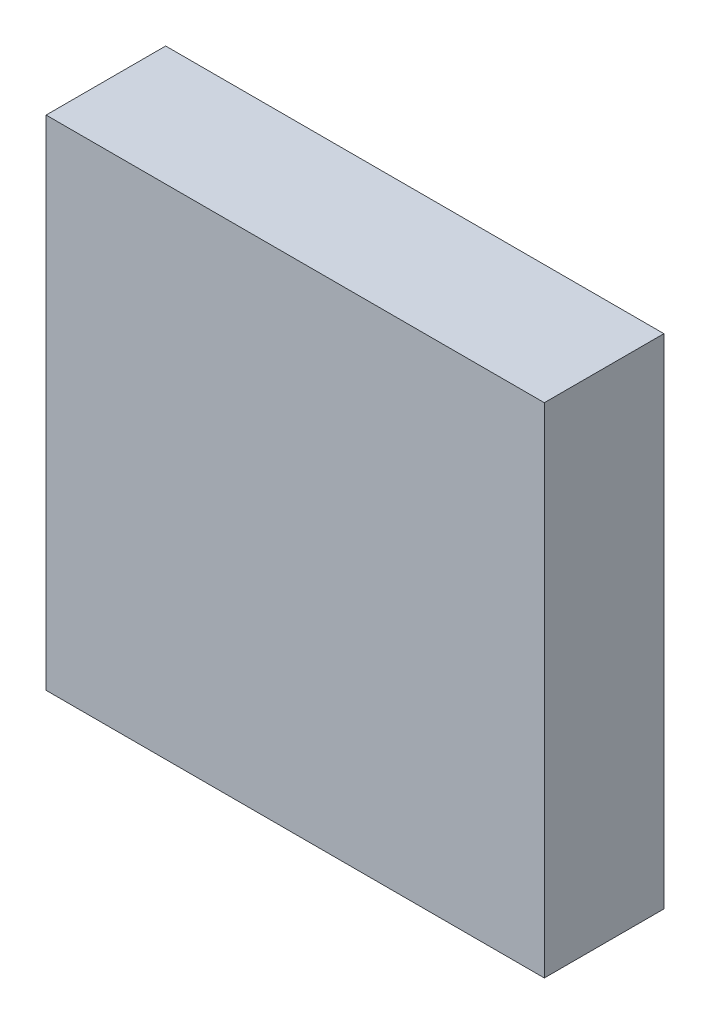
ISO-10303-21;
HEADER;
FILE_DESCRIPTION(('STEP AP214'),'2;1');
FILE_NAME('part.step','',(''),(''),'','','');
FILE_SCHEMA(('AUTOMOTIVE_DESIGN { 1 0 10303 214 1 1 1 1 }'));
ENDSEC;
DATA;
#1=APPLICATION_CONTEXT('core data for automotive mechanical design processes');
#2=APPLICATION_PROTOCOL_DEFINITION('international standard','automotive_design',2000,#1);
#3=PRODUCT_CONTEXT('',#1,'mechanical');
#4=PRODUCT('Part','Part','',(#3));
#5=PRODUCT_RELATED_PRODUCT_CATEGORY('part','',(#4));
#6=PRODUCT_DEFINITION_FORMATION('','',#4);
#7=PRODUCT_DEFINITION_CONTEXT('part definition',#1,'design');
#8=PRODUCT_DEFINITION('design','',#6,#7);
#9=PRODUCT_DEFINITION_SHAPE('','',#8);
#10=(LENGTH_UNIT() NAMED_UNIT(*) SI_UNIT(.MILLI.,.METRE.));
#11=(NAMED_UNIT(*) PLANE_ANGLE_UNIT() SI_UNIT($,.RADIAN.));
#12=(NAMED_UNIT(*) SI_UNIT($,.STERADIAN.) SOLID_ANGLE_UNIT());
#13=UNCERTAINTY_MEASURE_WITH_UNIT(LENGTH_MEASURE(1.E-05),#10,'distance_accuracy_value','');
#14=(GEOMETRIC_REPRESENTATION_CONTEXT(3) GLOBAL_UNCERTAINTY_ASSIGNED_CONTEXT((#13)) GLOBAL_UNIT_ASSIGNED_CONTEXT((#10,
#11,#12)) REPRESENTATION_CONTEXT('',''));
#15=CARTESIAN_POINT('',(0.,0.,0.));
#16=DIRECTION('',(0.,0.,1.));
#17=DIRECTION('',(1.,0.,0.));
#18=AXIS2_PLACEMENT_3D('',#15,#16,#17);
#19=CARTESIAN_POINT('',(233.308771728843,64.7931793490154,6.));
#20=DIRECTION('',(0.,1.,0.));
#21=DIRECTION('',(0.,0.,1.));
#22=AXIS2_PLACEMENT_3D('',#19,#20,#21);
#23=PLANE('',#22);
#24=DIRECTION('',(1.,0.,0.));
#25=VECTOR('',#24,1.);
#26=CARTESIAN_POINT('',(233.308771728843,64.7931793490154,0.));
#27=LINE('',#26,#25);
#28=CARTESIAN_POINT('',(208.308771728843,64.7931793490154,0.));
#29=VERTEX_POINT('',#28);
#30=CARTESIAN_POINT('',(233.308771728843,64.7931793490154,0.));
#31=VERTEX_POINT('',#30);
#32=EDGE_CURVE('E91',#29,#31,#27,.T.);
#33=ORIENTED_EDGE('',*,*,#32,.T.);
#34=DIRECTION('',(0.,0.,-1.));
#35=VECTOR('',#34,1.);
#36=CARTESIAN_POINT('',(233.308771728843,64.7931793490154,6.));
#37=LINE('',#36,#35);
#38=CARTESIAN_POINT('',(233.308771728843,64.7931793490154,6.));
#39=VERTEX_POINT('',#38);
#40=EDGE_CURVE('E45',#39,#31,#37,.T.);
#41=ORIENTED_EDGE('',*,*,#40,.F.);
#42=DIRECTION('',(1.,0.,0.));
#43=VECTOR('',#42,1.);
#44=CARTESIAN_POINT('',(233.308771728843,64.7931793490154,6.));
#45=LINE('',#44,#43);
#46=CARTESIAN_POINT('',(208.308771728843,64.7931793490154,6.));
#47=VERTEX_POINT('',#46);
#48=EDGE_CURVE('E84',#47,#39,#45,.T.);
#49=ORIENTED_EDGE('',*,*,#48,.F.);
#50=DIRECTION('',(0.,0.,-1.));
#51=VECTOR('',#50,1.);
#52=CARTESIAN_POINT('',(208.308771728843,64.7931793490154,6.));
#53=LINE('',#52,#51);
#54=EDGE_CURVE('E11',#47,#29,#53,.T.);
#55=ORIENTED_EDGE('',*,*,#54,.T.);
#56=EDGE_LOOP('',(#33,#41,#49,#55));
#57=FACE_BOUND('',#56,.T.);
#58=ADVANCED_FACE('F37',(#57),#23,.F.);
#59=CARTESIAN_POINT('',(233.308771728843,89.7931793490154,6.));
#60=DIRECTION('',(-1.,0.,0.));
#61=DIRECTION('',(0.,0.,1.));
#62=AXIS2_PLACEMENT_3D('',#59,#60,#61);
#63=PLANE('',#62);
#64=DIRECTION('',(0.,1.,0.));
#65=VECTOR('',#64,1.);
#66=CARTESIAN_POINT('',(233.308771728843,89.7931793490154,0.));
#67=LINE('',#66,#65);
#68=CARTESIAN_POINT('',(233.308771728843,89.7931793490154,0.));
#69=VERTEX_POINT('',#68);
#70=EDGE_CURVE('E71',#31,#69,#67,.T.);
#71=ORIENTED_EDGE('',*,*,#70,.T.);
#72=DIRECTION('',(0.,0.,-1.));
#73=VECTOR('',#72,1.);
#74=CARTESIAN_POINT('',(233.308771728843,89.7931793490154,6.));
#75=LINE('',#74,#73);
#76=CARTESIAN_POINT('',(233.308771728843,89.7931793490154,6.));
#77=VERTEX_POINT('',#76);
#78=EDGE_CURVE('E92',#77,#69,#75,.T.);
#79=ORIENTED_EDGE('',*,*,#78,.F.);
#80=DIRECTION('',(0.,1.,0.));
#81=VECTOR('',#80,1.);
#82=CARTESIAN_POINT('',(233.308771728843,89.7931793490154,6.));
#83=LINE('',#82,#81);
#84=EDGE_CURVE('E88',#39,#77,#83,.T.);
#85=ORIENTED_EDGE('',*,*,#84,.F.);
#86=ORIENTED_EDGE('',*,*,#40,.T.);
#87=EDGE_LOOP('',(#71,#79,#85,#86));
#88=FACE_BOUND('',#87,.T.);
#89=ADVANCED_FACE('F93',(#88),#63,.F.);
#90=CARTESIAN_POINT('',(208.308771728843,89.7931793490154,6.));
#91=DIRECTION('',(0.,-1.,0.));
#92=DIRECTION('',(0.,0.,-1.));
#93=AXIS2_PLACEMENT_3D('',#90,#91,#92);
#94=PLANE('',#93);
#95=DIRECTION('',(-1.,0.,0.));
#96=VECTOR('',#95,1.);
#97=CARTESIAN_POINT('',(208.308771728843,89.7931793490154,0.));
#98=LINE('',#97,#96);
#99=CARTESIAN_POINT('',(208.308771728843,89.7931793490154,0.));
#100=VERTEX_POINT('',#99);
#101=EDGE_CURVE('E78',#69,#100,#98,.T.);
#102=ORIENTED_EDGE('',*,*,#101,.T.);
#103=DIRECTION('',(0.,0.,-1.));
#104=VECTOR('',#103,1.);
#105=CARTESIAN_POINT('',(208.308771728843,89.7931793490154,6.));
#106=LINE('',#105,#104);
#107=CARTESIAN_POINT('',(208.308771728843,89.7931793490154,6.));
#108=VERTEX_POINT('',#107);
#109=EDGE_CURVE('E97',#108,#100,#106,.T.);
#110=ORIENTED_EDGE('',*,*,#109,.F.);
#111=DIRECTION('',(-1.,0.,0.));
#112=VECTOR('',#111,1.);
#113=CARTESIAN_POINT('',(208.308771728843,89.7931793490154,6.));
#114=LINE('',#113,#112);
#115=EDGE_CURVE('E95',#77,#108,#114,.T.);
#116=ORIENTED_EDGE('',*,*,#115,.F.);
#117=ORIENTED_EDGE('',*,*,#78,.T.);
#118=EDGE_LOOP('',(#102,#110,#116,#117));
#119=FACE_BOUND('',#118,.T.);
#120=ADVANCED_FACE('F107',(#119),#94,.F.);
#121=CARTESIAN_POINT('',(208.308771728843,77.2931793490154,6.));
#122=DIRECTION('',(1.,0.,0.));
#123=DIRECTION('',(0.,0.,-1.));
#124=AXIS2_PLACEMENT_3D('',#121,#122,#123);
#125=PLANE('',#124);
#126=DIRECTION('',(0.,-1.,0.));
#127=VECTOR('',#126,1.);
#128=CARTESIAN_POINT('',(208.308771728843,77.2931793490154,0.));
#129=LINE('',#128,#127);
#130=EDGE_CURVE('E104',#100,#29,#129,.T.);
#131=ORIENTED_EDGE('',*,*,#130,.T.);
#132=ORIENTED_EDGE('',*,*,#54,.F.);
#133=DIRECTION('',(0.,-1.,0.));
#134=VECTOR('',#133,1.);
#135=CARTESIAN_POINT('',(208.308771728843,64.7931793490154,6.));
#136=LINE('',#135,#134);
#137=EDGE_CURVE('E53',#108,#47,#136,.T.);
#138=ORIENTED_EDGE('',*,*,#137,.F.);
#139=ORIENTED_EDGE('',*,*,#109,.T.);
#140=EDGE_LOOP('',(#131,#132,#138,#139));
#141=FACE_BOUND('',#140,.T.);
#142=ADVANCED_FACE('F111',(#141),#125,.F.);
#143=CARTESIAN_POINT('',(0.,0.,6.));
#144=DIRECTION('',(0.,0.,-1.));
#145=DIRECTION('',(-1.,0.,0.));
#146=AXIS2_PLACEMENT_3D('',#143,#144,#145);
#147=PLANE('',#146);
#148=ORIENTED_EDGE('',*,*,#137,.T.);
#149=ORIENTED_EDGE('',*,*,#48,.T.);
#150=ORIENTED_EDGE('',*,*,#84,.T.);
#151=ORIENTED_EDGE('',*,*,#115,.T.);
#152=EDGE_LOOP('',(#148,#149,#150,#151));
#153=FACE_BOUND('',#152,.T.);
#154=ADVANCED_FACE('F86',(#153),#147,.F.);
#155=CARTESIAN_POINT('',(0.,0.,0.));
#156=DIRECTION('',(0.,0.,-1.));
#157=DIRECTION('',(-1.,0.,0.));
#158=AXIS2_PLACEMENT_3D('',#155,#156,#157);
#159=PLANE('',#158);
#160=ORIENTED_EDGE('',*,*,#32,.F.);
#161=ORIENTED_EDGE('',*,*,#130,.F.);
#162=ORIENTED_EDGE('',*,*,#101,.F.);
#163=ORIENTED_EDGE('',*,*,#70,.F.);
#164=EDGE_LOOP('',(#160,#161,#162,#163));
#165=FACE_BOUND('',#164,.T.);
#166=ADVANCED_FACE('F110',(#165),#159,.T.);
#167=CLOSED_SHELL('',(#58,#89,#120,#142,#154,#166));
#168=MANIFOLD_SOLID_BREP('B2',#167);
#169=ADVANCED_BREP_SHAPE_REPRESENTATION('',(#18,#168),#14);
#170=SHAPE_DEFINITION_REPRESENTATION(#9,#169);
ENDSEC;
END-ISO-10303-21;
